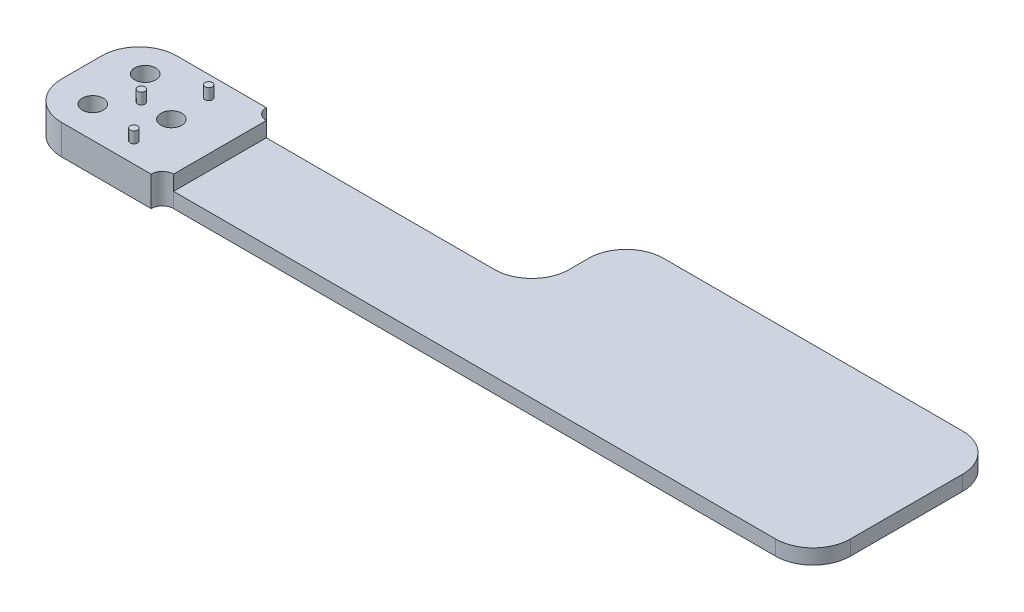
ISO-10303-21;
HEADER;
FILE_DESCRIPTION(('STEP AP214'),'2;1');
FILE_NAME('part.step','',(''),(''),'','','');
FILE_SCHEMA(('AUTOMOTIVE_DESIGN { 1 0 10303 214 1 1 1 1 }'));
ENDSEC;
DATA;
#1=APPLICATION_CONTEXT('core data for automotive mechanical design processes');
#2=APPLICATION_PROTOCOL_DEFINITION('international standard','automotive_design',2000,#1);
#3=PRODUCT_CONTEXT('',#1,'mechanical');
#4=PRODUCT('Part','Part','',(#3));
#5=PRODUCT_RELATED_PRODUCT_CATEGORY('part','',(#4));
#6=PRODUCT_DEFINITION_FORMATION('','',#4);
#7=PRODUCT_DEFINITION_CONTEXT('part definition',#1,'design');
#8=PRODUCT_DEFINITION('design','',#6,#7);
#9=PRODUCT_DEFINITION_SHAPE('','',#8);
#10=(LENGTH_UNIT() NAMED_UNIT(*) SI_UNIT(.MILLI.,.METRE.));
#11=(NAMED_UNIT(*) PLANE_ANGLE_UNIT() SI_UNIT($,.RADIAN.));
#12=(NAMED_UNIT(*) SI_UNIT($,.STERADIAN.) SOLID_ANGLE_UNIT());
#13=UNCERTAINTY_MEASURE_WITH_UNIT(LENGTH_MEASURE(1.E-05),#10,'distance_accuracy_value','');
#14=(GEOMETRIC_REPRESENTATION_CONTEXT(3) GLOBAL_UNCERTAINTY_ASSIGNED_CONTEXT((#13)) GLOBAL_UNIT_ASSIGNED_CONTEXT((#10,
#11,#12)) REPRESENTATION_CONTEXT('',''));
#15=CARTESIAN_POINT('',(0.,0.,0.));
#16=DIRECTION('',(0.,0.,1.));
#17=DIRECTION('',(1.,0.,0.));
#18=AXIS2_PLACEMENT_3D('',#15,#16,#17);
#19=CARTESIAN_POINT('',(54.,2.,0.));
#20=DIRECTION('',(0.,-1.,0.));
#21=DIRECTION('',(0.,0.,-1.));
#22=AXIS2_PLACEMENT_3D('',#19,#20,#21);
#23=PLANE('',#22);
#24=DIRECTION('',(0.,0.,-1.));
#25=VECTOR('',#24,1.);
#26=CARTESIAN_POINT('',(18.5,2.,0.));
#27=LINE('',#26,#25);
#28=CARTESIAN_POINT('',(18.5,2.,0.));
#29=VERTEX_POINT('',#28);
#30=CARTESIAN_POINT('',(18.5,2.,-12.4));
#31=VERTEX_POINT('',#30);
#32=EDGE_CURVE('E178',#29,#31,#27,.T.);
#33=ORIENTED_EDGE('',*,*,#32,.F.);
#34=DIRECTION('',(-1.,0.,0.));
#35=VECTOR('',#34,1.);
#36=CARTESIAN_POINT('',(54.,2.,0.));
#37=LINE('',#36,#35);
#38=CARTESIAN_POINT('',(99.,2.,0.));
#39=VERTEX_POINT('',#38);
#40=EDGE_CURVE('E169',#39,#29,#37,.T.);
#41=ORIENTED_EDGE('',*,*,#40,.F.);
#42=CARTESIAN_POINT('',(99.,2.,-5.));
#43=DIRECTION('',(0.,-1.,0.));
#44=DIRECTION('',(0.,0.,-1.));
#45=AXIS2_PLACEMENT_3D('',#42,#43,#44);
#46=CIRCLE('',#45,5.);
#47=CARTESIAN_POINT('',(104.,2.,-5.));
#48=VERTEX_POINT('',#47);
#49=EDGE_CURVE('E326',#39,#48,#46,.F.);
#50=ORIENTED_EDGE('',*,*,#49,.T.);
#51=DIRECTION('',(0.,0.,-1.));
#52=VECTOR('',#51,1.);
#53=CARTESIAN_POINT('',(104.,2.,0.));
#54=LINE('',#53,#52);
#55=CARTESIAN_POINT('',(104.,2.,-20.));
#56=VERTEX_POINT('',#55);
#57=EDGE_CURVE('E194',#48,#56,#54,.T.);
#58=ORIENTED_EDGE('',*,*,#57,.T.);
#59=CARTESIAN_POINT('',(99.,2.,-20.));
#60=DIRECTION('',(0.,-1.,0.));
#61=DIRECTION('',(0.,0.,-1.));
#62=AXIS2_PLACEMENT_3D('',#59,#60,#61);
#63=CIRCLE('',#62,5.);
#64=CARTESIAN_POINT('',(99.,2.,-25.));
#65=VERTEX_POINT('',#64);
#66=EDGE_CURVE('E45',#56,#65,#63,.F.);
#67=ORIENTED_EDGE('',*,*,#66,.T.);
#68=DIRECTION('',(-1.,0.,0.));
#69=VECTOR('',#68,1.);
#70=CARTESIAN_POINT('',(54.,2.,-25.));
#71=LINE('',#70,#69);
#72=CARTESIAN_POINT('',(59.,2.,-25.));
#73=VERTEX_POINT('',#72);
#74=EDGE_CURVE('E200',#65,#73,#71,.T.);
#75=ORIENTED_EDGE('',*,*,#74,.T.);
#76=CARTESIAN_POINT('',(59.,2.,-20.));
#77=DIRECTION('',(0.,-1.,0.));
#78=DIRECTION('',(0.,0.,-1.));
#79=AXIS2_PLACEMENT_3D('',#76,#77,#78);
#80=CIRCLE('',#79,5.);
#81=CARTESIAN_POINT('',(54.,2.,-20.));
#82=VERTEX_POINT('',#81);
#83=EDGE_CURVE('E307',#73,#82,#80,.F.);
#84=ORIENTED_EDGE('',*,*,#83,.T.);
#85=DIRECTION('',(0.,0.,1.));
#86=VECTOR('',#85,1.);
#87=CARTESIAN_POINT('',(54.,2.,0.));
#88=LINE('',#87,#86);
#89=CARTESIAN_POINT('',(54.,2.,-17.4));
#90=VERTEX_POINT('',#89);
#91=EDGE_CURVE('E196',#82,#90,#88,.T.);
#92=ORIENTED_EDGE('',*,*,#91,.T.);
#93=CARTESIAN_POINT('',(49.,2.,-17.4));
#94=DIRECTION('',(0.,-1.,0.));
#95=DIRECTION('',(0.,0.,-1.));
#96=AXIS2_PLACEMENT_3D('',#93,#94,#95);
#97=CIRCLE('',#96,5.);
#98=CARTESIAN_POINT('',(49.,2.,-12.4));
#99=VERTEX_POINT('',#98);
#100=EDGE_CURVE('E311',#90,#99,#97,.T.);
#101=ORIENTED_EDGE('',*,*,#100,.T.);
#102=DIRECTION('',(-1.,0.,0.));
#103=VECTOR('',#102,1.);
#104=CARTESIAN_POINT('',(54.,2.,-12.4));
#105=LINE('',#104,#103);
#106=EDGE_CURVE('E174',#99,#31,#105,.T.);
#107=ORIENTED_EDGE('',*,*,#106,.T.);
#108=EDGE_LOOP('',(#33,#41,#50,#58,#67,#75,#84,#92,#101,#107));
#109=FACE_BOUND('',#108,.T.);
#110=ADVANCED_FACE('F37',(#109),#23,.F.);
#111=CARTESIAN_POINT('',(0.,4.,-12.4));
#112=DIRECTION('',(0.,0.,1.));
#113=DIRECTION('',(1.,0.,0.));
#114=AXIS2_PLACEMENT_3D('',#111,#112,#113);
#115=PLANE('',#114);
#116=ORIENTED_EDGE('',*,*,#106,.F.);
#117=DIRECTION('',(0.,1.,0.));
#118=VECTOR('',#117,1.);
#119=CARTESIAN_POINT('',(49.,4.,-12.4));
#120=LINE('',#119,#118);
#121=CARTESIAN_POINT('',(49.,0.,-12.4));
#122=VERTEX_POINT('',#121);
#123=EDGE_CURVE('E309',#99,#122,#120,.F.);
#124=ORIENTED_EDGE('',*,*,#123,.T.);
#125=DIRECTION('',(-1.,0.,0.));
#126=VECTOR('',#125,1.);
#127=CARTESIAN_POINT('',(0.,0.,-12.4));
#128=LINE('',#127,#126);
#129=CARTESIAN_POINT('',(18.5,0.,-12.4));
#130=VERTEX_POINT('',#129);
#131=EDGE_CURVE('E264',#122,#130,#128,.T.);
#132=ORIENTED_EDGE('',*,*,#131,.T.);
#133=DIRECTION('',(0.,1.,0.));
#134=VECTOR('',#133,1.);
#135=CARTESIAN_POINT('',(18.5,-2.12132034355964,-12.4));
#136=LINE('',#135,#134);
#137=EDGE_CURVE('E167',#130,#31,#136,.T.);
#138=ORIENTED_EDGE('',*,*,#137,.T.);
#139=EDGE_LOOP('',(#116,#124,#132,#138));
#140=FACE_BOUND('',#139,.T.);
#141=ADVANCED_FACE('F394',(#140),#115,.F.);
#142=CARTESIAN_POINT('',(0.,4.,0.));
#143=DIRECTION('',(0.,0.,-1.));
#144=DIRECTION('',(-1.,0.,0.));
#145=AXIS2_PLACEMENT_3D('',#142,#143,#144);
#146=PLANE('',#145);
#147=DIRECTION('',(1.,0.,0.));
#148=VECTOR('',#147,1.);
#149=CARTESIAN_POINT('',(0.,0.,0.));
#150=LINE('',#149,#148);
#151=CARTESIAN_POINT('',(18.5,0.,0.));
#152=VERTEX_POINT('',#151);
#153=CARTESIAN_POINT('',(99.,0.,0.));
#154=VERTEX_POINT('',#153);
#155=EDGE_CURVE('E267',#152,#154,#150,.T.);
#156=ORIENTED_EDGE('',*,*,#155,.T.);
#157=DIRECTION('',(0.,-1.,0.));
#158=VECTOR('',#157,1.);
#159=CARTESIAN_POINT('',(99.,2.,0.));
#160=LINE('',#159,#158);
#161=EDGE_CURVE('E11',#154,#39,#160,.F.);
#162=ORIENTED_EDGE('',*,*,#161,.T.);
#163=ORIENTED_EDGE('',*,*,#40,.T.);
#164=DIRECTION('',(0.,1.,0.));
#165=VECTOR('',#164,1.);
#166=CARTESIAN_POINT('',(18.5,-2.12132034355964,0.));
#167=LINE('',#166,#165);
#168=EDGE_CURVE('E158',#152,#29,#167,.T.);
#169=ORIENTED_EDGE('',*,*,#168,.F.);
#170=EDGE_LOOP('',(#156,#162,#163,#169));
#171=FACE_BOUND('',#170,.T.);
#172=ADVANCED_FACE('F171',(#171),#146,.F.);
#173=CARTESIAN_POINT('',(0.,4.,0.));
#174=DIRECTION('',(1.,0.,0.));
#175=DIRECTION('',(0.,0.,-1.));
#176=AXIS2_PLACEMENT_3D('',#173,#174,#175);
#177=PLANE('',#176);
#178=DIRECTION('',(0.,0.,1.));
#179=VECTOR('',#178,1.);
#180=CARTESIAN_POINT('',(0.,4.,0.));
#181=LINE('',#180,#179);
#182=CARTESIAN_POINT('',(0.,4.,-8.89999999999999));
#183=VERTEX_POINT('',#182);
#184=CARTESIAN_POINT('',(0.,4.,-3.5));
#185=VERTEX_POINT('',#184);
#186=EDGE_CURVE('E260',#183,#185,#181,.T.);
#187=ORIENTED_EDGE('',*,*,#186,.F.);
#188=DIRECTION('',(0.,1.,0.));
#189=VECTOR('',#188,1.);
#190=CARTESIAN_POINT('',(0.,0.,-8.9));
#191=LINE('',#190,#189);
#192=CARTESIAN_POINT('',(0.,0.,-8.89999999999999));
#193=VERTEX_POINT('',#192);
#194=EDGE_CURVE('E279',#183,#193,#191,.F.);
#195=ORIENTED_EDGE('',*,*,#194,.T.);
#196=DIRECTION('',(0.,0.,1.));
#197=VECTOR('',#196,1.);
#198=CARTESIAN_POINT('',(0.,0.,0.));
#199=LINE('',#198,#197);
#200=CARTESIAN_POINT('',(0.,0.,-3.5));
#201=VERTEX_POINT('',#200);
#202=EDGE_CURVE('E245',#193,#201,#199,.T.);
#203=ORIENTED_EDGE('',*,*,#202,.T.);
#204=DIRECTION('',(0.,1.,0.));
#205=VECTOR('',#204,1.);
#206=CARTESIAN_POINT('',(0.,4.,-3.5));
#207=LINE('',#206,#205);
#208=EDGE_CURVE('E276',#201,#185,#207,.T.);
#209=ORIENTED_EDGE('',*,*,#208,.T.);
#210=EDGE_LOOP('',(#187,#195,#203,#209));
#211=FACE_BOUND('',#210,.T.);
#212=ADVANCED_FACE('F355',(#211),#177,.F.);
#213=CARTESIAN_POINT('',(0.,4.,0.));
#214=DIRECTION('',(0.,-1.,0.));
#215=DIRECTION('',(0.,0.,-1.));
#216=AXIS2_PLACEMENT_3D('',#213,#214,#215);
#217=PLANE('',#216);
#218=CARTESIAN_POINT('',(12.,4.,-1.2));
#219=DIRECTION('',(0.,-1.,0.));
#220=DIRECTION('',(0.,0.,-1.));
#221=AXIS2_PLACEMENT_3D('',#218,#219,#220);
#222=CIRCLE('',#221,0.500000000000001);
#223=CARTESIAN_POINT('',(12.,4.,-1.7));
#224=VERTEX_POINT('',#223);
#225=EDGE_CURVE('E293',#224,#224,#222,.F.);
#226=ORIENTED_EDGE('',*,*,#225,.F.);
#227=EDGE_LOOP('',(#226));
#228=FACE_BOUND('',#227,.T.);
#229=CARTESIAN_POINT('',(12.,4.,-11.2));
#230=DIRECTION('',(0.,-1.,0.));
#231=DIRECTION('',(0.,0.,-1.));
#232=AXIS2_PLACEMENT_3D('',#229,#230,#231);
#233=CIRCLE('',#232,0.500000000000001);
#234=CARTESIAN_POINT('',(12.,4.,-11.7));
#235=VERTEX_POINT('',#234);
#236=EDGE_CURVE('E290',#235,#235,#233,.F.);
#237=ORIENTED_EDGE('',*,*,#236,.F.);
#238=EDGE_LOOP('',(#237));
#239=FACE_BOUND('',#238,.T.);
#240=CARTESIAN_POINT('',(8.,4.,-6.2));
#241=DIRECTION('',(0.,-1.,0.));
#242=DIRECTION('',(0.,0.,-1.));
#243=AXIS2_PLACEMENT_3D('',#240,#241,#242);
#244=CIRCLE('',#243,0.500000000000001);
#245=CARTESIAN_POINT('',(8.,4.,-6.7));
#246=VERTEX_POINT('',#245);
#247=EDGE_CURVE('E287',#246,#246,#244,.F.);
#248=ORIENTED_EDGE('',*,*,#247,.F.);
#249=EDGE_LOOP('',(#248));
#250=FACE_BOUND('',#249,.T.);
#251=CARTESIAN_POINT('',(12.,4.,-6.2));
#252=DIRECTION('',(0.,1.,0.));
#253=DIRECTION('',(0.,0.,1.));
#254=AXIS2_PLACEMENT_3D('',#251,#252,#253);
#255=CIRCLE('',#254,1.4);
#256=CARTESIAN_POINT('',(12.,4.,-4.8));
#257=VERTEX_POINT('',#256);
#258=EDGE_CURVE('E246',#257,#257,#255,.T.);
#259=ORIENTED_EDGE('',*,*,#258,.F.);
#260=EDGE_LOOP('',(#259));
#261=FACE_BOUND('',#260,.T.);
#262=CARTESIAN_POINT('',(5.,4.,-9.7));
#263=DIRECTION('',(0.,1.,0.));
#264=DIRECTION('',(0.,0.,1.));
#265=AXIS2_PLACEMENT_3D('',#262,#263,#264);
#266=CIRCLE('',#265,1.4);
#267=CARTESIAN_POINT('',(5.,4.,-8.3));
#268=VERTEX_POINT('',#267);
#269=EDGE_CURVE('E252',#268,#268,#266,.T.);
#270=ORIENTED_EDGE('',*,*,#269,.F.);
#271=EDGE_LOOP('',(#270));
#272=FACE_BOUND('',#271,.T.);
#273=CARTESIAN_POINT('',(5.,4.,-2.7));
#274=DIRECTION('',(0.,1.,0.));
#275=DIRECTION('',(0.,0.,1.));
#276=AXIS2_PLACEMENT_3D('',#273,#274,#275);
#277=CIRCLE('',#276,1.4);
#278=CARTESIAN_POINT('',(5.,4.,-1.3));
#279=VERTEX_POINT('',#278);
#280=EDGE_CURVE('E241',#279,#279,#277,.T.);
#281=ORIENTED_EDGE('',*,*,#280,.F.);
#282=EDGE_LOOP('',(#281));
#283=FACE_BOUND('',#282,.T.);
#284=DIRECTION('',(-1.,0.,0.));
#285=VECTOR('',#284,1.);
#286=CARTESIAN_POINT('',(17.,4.,-13.9));
#287=LINE('',#286,#285);
#288=CARTESIAN_POINT('',(17.,4.,-13.9));
#289=VERTEX_POINT('',#288);
#290=CARTESIAN_POINT('',(5.,4.,-13.9));
#291=VERTEX_POINT('',#290);
#292=EDGE_CURVE('E233',#289,#291,#287,.T.);
#293=ORIENTED_EDGE('',*,*,#292,.T.);
#294=CARTESIAN_POINT('',(5.,4.,-8.9));
#295=DIRECTION('',(0.,-1.,0.));
#296=DIRECTION('',(0.,0.,-1.));
#297=AXIS2_PLACEMENT_3D('',#294,#295,#296);
#298=CIRCLE('',#297,5.);
#299=EDGE_CURVE('E274',#291,#183,#298,.F.);
#300=ORIENTED_EDGE('',*,*,#299,.T.);
#301=ORIENTED_EDGE('',*,*,#186,.T.);
#302=CARTESIAN_POINT('',(5.,4.,-3.5));
#303=DIRECTION('',(0.,-1.,0.));
#304=DIRECTION('',(0.,0.,-1.));
#305=AXIS2_PLACEMENT_3D('',#302,#303,#304);
#306=CIRCLE('',#305,5.);
#307=CARTESIAN_POINT('',(5.,4.,1.5));
#308=VERTEX_POINT('',#307);
#309=EDGE_CURVE('E272',#185,#308,#306,.F.);
#310=ORIENTED_EDGE('',*,*,#309,.T.);
#311=DIRECTION('',(1.,0.,0.));
#312=VECTOR('',#311,1.);
#313=CARTESIAN_POINT('',(17.,4.,1.5));
#314=LINE('',#313,#312);
#315=CARTESIAN_POINT('',(17.,4.,1.5));
#316=VERTEX_POINT('',#315);
#317=EDGE_CURVE('E225',#308,#316,#314,.T.);
#318=ORIENTED_EDGE('',*,*,#317,.T.);
#319=CARTESIAN_POINT('',(18.5,4.,1.5));
#320=DIRECTION('',(0.,-1.,0.));
#321=DIRECTION('',(0.,0.,-1.));
#322=AXIS2_PLACEMENT_3D('',#319,#320,#321);
#323=CIRCLE('',#322,1.5);
#324=CARTESIAN_POINT('',(18.5,4.,0.));
#325=VERTEX_POINT('',#324);
#326=EDGE_CURVE('E205',#325,#316,#323,.F.);
#327=ORIENTED_EDGE('',*,*,#326,.F.);
#328=DIRECTION('',(0.,0.,1.));
#329=VECTOR('',#328,1.);
#330=CARTESIAN_POINT('',(18.5,4.,0.));
#331=LINE('',#330,#329);
#332=CARTESIAN_POINT('',(18.5,4.,-12.4));
#333=VERTEX_POINT('',#332);
#334=EDGE_CURVE('E186',#333,#325,#331,.T.);
#335=ORIENTED_EDGE('',*,*,#334,.F.);
#336=CARTESIAN_POINT('',(18.5,4.,-13.9));
#337=DIRECTION('',(0.,-1.,0.));
#338=DIRECTION('',(0.,0.,-1.));
#339=AXIS2_PLACEMENT_3D('',#336,#337,#338);
#340=CIRCLE('',#339,1.5);
#341=EDGE_CURVE('E187',#289,#333,#340,.F.);
#342=ORIENTED_EDGE('',*,*,#341,.F.);
#343=EDGE_LOOP('',(#293,#300,#301,#310,#318,#327,#335,#342));
#344=FACE_BOUND('',#343,.T.);
#345=ADVANCED_FACE('F428',(#228,#239,#250,#261,#272,#283,#344),#217,.F.);
#346=CARTESIAN_POINT('',(0.,0.,0.));
#347=DIRECTION('',(0.,-1.,0.));
#348=DIRECTION('',(0.,0.,-1.));
#349=AXIS2_PLACEMENT_3D('',#346,#347,#348);
#350=PLANE('',#349);
#351=DIRECTION('',(1.,0.,0.));
#352=VECTOR('',#351,1.);
#353=CARTESIAN_POINT('',(54.,0.,-25.));
#354=LINE('',#353,#352);
#355=CARTESIAN_POINT('',(59.,0.,-25.));
#356=VERTEX_POINT('',#355);
#357=CARTESIAN_POINT('',(99.,0.,-25.));
#358=VERTEX_POINT('',#357);
#359=EDGE_CURVE('E204',#356,#358,#354,.T.);
#360=ORIENTED_EDGE('',*,*,#359,.T.);
#361=CARTESIAN_POINT('',(99.,0.,-20.));
#362=DIRECTION('',(0.,-1.,0.));
#363=DIRECTION('',(0.,0.,-1.));
#364=AXIS2_PLACEMENT_3D('',#361,#362,#363);
#365=CIRCLE('',#364,5.);
#366=CARTESIAN_POINT('',(104.,0.,-20.));
#367=VERTEX_POINT('',#366);
#368=EDGE_CURVE('E320',#358,#367,#365,.T.);
#369=ORIENTED_EDGE('',*,*,#368,.T.);
#370=DIRECTION('',(0.,0.,1.));
#371=VECTOR('',#370,1.);
#372=CARTESIAN_POINT('',(104.,0.,0.));
#373=LINE('',#372,#371);
#374=CARTESIAN_POINT('',(104.,0.,-5.));
#375=VERTEX_POINT('',#374);
#376=EDGE_CURVE('E197',#367,#375,#373,.T.);
#377=ORIENTED_EDGE('',*,*,#376,.T.);
#378=CARTESIAN_POINT('',(99.,0.,-5.));
#379=DIRECTION('',(0.,-1.,0.));
#380=DIRECTION('',(0.,0.,-1.));
#381=AXIS2_PLACEMENT_3D('',#378,#379,#380);
#382=CIRCLE('',#381,5.);
#383=EDGE_CURVE('E318',#375,#154,#382,.T.);
#384=ORIENTED_EDGE('',*,*,#383,.T.);
#385=ORIENTED_EDGE('',*,*,#155,.F.);
#386=CARTESIAN_POINT('',(18.5,0.,1.5));
#387=DIRECTION('',(0.,-1.,0.));
#388=DIRECTION('',(0.,0.,-1.));
#389=AXIS2_PLACEMENT_3D('',#386,#387,#388);
#390=CIRCLE('',#389,1.5);
#391=CARTESIAN_POINT('',(17.,0.,1.5));
#392=VERTEX_POINT('',#391);
#393=EDGE_CURVE('E165',#392,#152,#390,.T.);
#394=ORIENTED_EDGE('',*,*,#393,.F.);
#395=DIRECTION('',(1.,0.,0.));
#396=VECTOR('',#395,1.);
#397=CARTESIAN_POINT('',(17.,0.,1.5));
#398=LINE('',#397,#396);
#399=CARTESIAN_POINT('',(5.,0.,1.5));
#400=VERTEX_POINT('',#399);
#401=EDGE_CURVE('E228',#400,#392,#398,.T.);
#402=ORIENTED_EDGE('',*,*,#401,.F.);
#403=CARTESIAN_POINT('',(5.,0.,-3.5));
#404=DIRECTION('',(0.,-1.,0.));
#405=DIRECTION('',(0.,0.,-1.));
#406=AXIS2_PLACEMENT_3D('',#403,#404,#405);
#407=CIRCLE('',#406,5.);
#408=EDGE_CURVE('E281',#400,#201,#407,.T.);
#409=ORIENTED_EDGE('',*,*,#408,.T.);
#410=ORIENTED_EDGE('',*,*,#202,.F.);
#411=CARTESIAN_POINT('',(5.,0.,-8.9));
#412=DIRECTION('',(0.,-1.,0.));
#413=DIRECTION('',(0.,0.,-1.));
#414=AXIS2_PLACEMENT_3D('',#411,#412,#413);
#415=CIRCLE('',#414,5.);
#416=CARTESIAN_POINT('',(5.,0.,-13.9));
#417=VERTEX_POINT('',#416);
#418=EDGE_CURVE('E283',#193,#417,#415,.T.);
#419=ORIENTED_EDGE('',*,*,#418,.T.);
#420=DIRECTION('',(-1.,0.,0.));
#421=VECTOR('',#420,1.);
#422=CARTESIAN_POINT('',(17.,0.,-13.9));
#423=LINE('',#422,#421);
#424=CARTESIAN_POINT('',(17.,0.,-13.9));
#425=VERTEX_POINT('',#424);
#426=EDGE_CURVE('E236',#425,#417,#423,.T.);
#427=ORIENTED_EDGE('',*,*,#426,.F.);
#428=CARTESIAN_POINT('',(18.5,0.,-13.9));
#429=DIRECTION('',(0.,-1.,0.));
#430=DIRECTION('',(0.,0.,-1.));
#431=AXIS2_PLACEMENT_3D('',#428,#429,#430);
#432=CIRCLE('',#431,1.5);
#433=EDGE_CURVE('E212',#130,#425,#432,.T.);
#434=ORIENTED_EDGE('',*,*,#433,.F.);
#435=ORIENTED_EDGE('',*,*,#131,.F.);
#436=CARTESIAN_POINT('',(49.,0.,-17.4));
#437=DIRECTION('',(0.,-1.,0.));
#438=DIRECTION('',(0.,0.,-1.));
#439=AXIS2_PLACEMENT_3D('',#436,#437,#438);
#440=CIRCLE('',#439,5.);
#441=CARTESIAN_POINT('',(54.,0.,-17.4));
#442=VERTEX_POINT('',#441);
#443=EDGE_CURVE('E313',#122,#442,#440,.F.);
#444=ORIENTED_EDGE('',*,*,#443,.T.);
#445=DIRECTION('',(0.,0.,-1.));
#446=VECTOR('',#445,1.);
#447=CARTESIAN_POINT('',(54.,0.,0.));
#448=LINE('',#447,#446);
#449=CARTESIAN_POINT('',(54.,0.,-20.));
#450=VERTEX_POINT('',#449);
#451=EDGE_CURVE('E201',#442,#450,#448,.T.);
#452=ORIENTED_EDGE('',*,*,#451,.T.);
#453=CARTESIAN_POINT('',(59.,0.,-20.));
#454=DIRECTION('',(0.,-1.,0.));
#455=DIRECTION('',(0.,0.,-1.));
#456=AXIS2_PLACEMENT_3D('',#453,#454,#455);
#457=CIRCLE('',#456,5.);
#458=EDGE_CURVE('E302',#450,#356,#457,.T.);
#459=ORIENTED_EDGE('',*,*,#458,.T.);
#460=EDGE_LOOP('',(#360,#369,#377,#384,#385,#394,#402,#409,#410,#419,#427,#434,#435,#444,#452,#459));
#461=FACE_BOUND('',#460,.T.);
#462=ADVANCED_FACE('F338',(#461),#350,.T.);
#463=CARTESIAN_POINT('',(5.,1.,-2.7));
#464=DIRECTION('',(0.,1.,0.));
#465=DIRECTION('',(0.,0.,1.));
#466=AXIS2_PLACEMENT_3D('',#463,#464,#465);
#467=CYLINDRICAL_SURFACE('',#466,1.4);
#468=CARTESIAN_POINT('',(5.,1.,-2.7));
#469=DIRECTION('',(0.,1.,0.));
#470=DIRECTION('',(0.,0.,1.));
#471=AXIS2_PLACEMENT_3D('',#468,#469,#470);
#472=CIRCLE('',#471,1.4);
#473=CARTESIAN_POINT('',(5.,1.,-1.3));
#474=VERTEX_POINT('',#473);
#475=EDGE_CURVE('E255',#474,#474,#472,.T.);
#476=ORIENTED_EDGE('',*,*,#475,.F.);
#477=EDGE_LOOP('',(#476));
#478=FACE_BOUND('',#477,.T.);
#479=ORIENTED_EDGE('',*,*,#280,.T.);
#480=EDGE_LOOP('',(#479));
#481=FACE_BOUND('',#480,.T.);
#482=ADVANCED_FACE('F423',(#478,#481),#467,.F.);
#483=CARTESIAN_POINT('',(5.,1.,-2.7));
#484=DIRECTION('',(0.,1.,0.));
#485=DIRECTION('',(0.,0.,1.));
#486=AXIS2_PLACEMENT_3D('',#483,#484,#485);
#487=PLANE('',#486);
#488=ORIENTED_EDGE('',*,*,#475,.T.);
#489=EDGE_LOOP('',(#488));
#490=FACE_BOUND('',#489,.T.);
#491=ADVANCED_FACE('F419',(#490),#487,.T.);
#492=CARTESIAN_POINT('',(5.,1.,-9.7));
#493=DIRECTION('',(0.,1.,0.));
#494=DIRECTION('',(0.,0.,1.));
#495=AXIS2_PLACEMENT_3D('',#492,#493,#494);
#496=CYLINDRICAL_SURFACE('',#495,1.4);
#497=CARTESIAN_POINT('',(5.,1.,-9.7));
#498=DIRECTION('',(0.,1.,0.));
#499=DIRECTION('',(0.,0.,1.));
#500=AXIS2_PLACEMENT_3D('',#497,#498,#499);
#501=CIRCLE('',#500,1.4);
#502=CARTESIAN_POINT('',(5.,1.,-8.3));
#503=VERTEX_POINT('',#502);
#504=EDGE_CURVE('E249',#503,#503,#501,.T.);
#505=ORIENTED_EDGE('',*,*,#504,.F.);
#506=EDGE_LOOP('',(#505));
#507=FACE_BOUND('',#506,.T.);
#508=ORIENTED_EDGE('',*,*,#269,.T.);
#509=EDGE_LOOP('',(#508));
#510=FACE_BOUND('',#509,.T.);
#511=ADVANCED_FACE('F415',(#507,#510),#496,.F.);
#512=CARTESIAN_POINT('',(5.,1.,-9.7));
#513=DIRECTION('',(0.,1.,0.));
#514=DIRECTION('',(0.,0.,1.));
#515=AXIS2_PLACEMENT_3D('',#512,#513,#514);
#516=PLANE('',#515);
#517=ORIENTED_EDGE('',*,*,#504,.T.);
#518=EDGE_LOOP('',(#517));
#519=FACE_BOUND('',#518,.T.);
#520=ADVANCED_FACE('F411',(#519),#516,.T.);
#521=CARTESIAN_POINT('',(12.,1.,-6.2));
#522=DIRECTION('',(0.,1.,0.));
#523=DIRECTION('',(0.,0.,1.));
#524=AXIS2_PLACEMENT_3D('',#521,#522,#523);
#525=CYLINDRICAL_SURFACE('',#524,1.4);
#526=CARTESIAN_POINT('',(12.,1.,-6.2));
#527=DIRECTION('',(0.,1.,0.));
#528=DIRECTION('',(0.,0.,1.));
#529=AXIS2_PLACEMENT_3D('',#526,#527,#528);
#530=CIRCLE('',#529,1.4);
#531=CARTESIAN_POINT('',(12.,1.,-4.8));
#532=VERTEX_POINT('',#531);
#533=EDGE_CURVE('E242',#532,#532,#530,.T.);
#534=ORIENTED_EDGE('',*,*,#533,.F.);
#535=EDGE_LOOP('',(#534));
#536=FACE_BOUND('',#535,.T.);
#537=ORIENTED_EDGE('',*,*,#258,.T.);
#538=EDGE_LOOP('',(#537));
#539=FACE_BOUND('',#538,.T.);
#540=ADVANCED_FACE('F407',(#536,#539),#525,.F.);
#541=CARTESIAN_POINT('',(12.,1.,-6.2));
#542=DIRECTION('',(0.,1.,0.));
#543=DIRECTION('',(0.,0.,1.));
#544=AXIS2_PLACEMENT_3D('',#541,#542,#543);
#545=PLANE('',#544);
#546=ORIENTED_EDGE('',*,*,#533,.T.);
#547=EDGE_LOOP('',(#546));
#548=FACE_BOUND('',#547,.T.);
#549=ADVANCED_FACE('F404',(#548),#545,.T.);
#550=CARTESIAN_POINT('',(17.,-17.066048165876,-13.9));
#551=DIRECTION('',(0.,0.,-1.));
#552=DIRECTION('',(-1.,0.,0.));
#553=AXIS2_PLACEMENT_3D('',#550,#551,#552);
#554=PLANE('',#553);
#555=ORIENTED_EDGE('',*,*,#426,.T.);
#556=DIRECTION('',(0.,1.,0.));
#557=VECTOR('',#556,1.);
#558=CARTESIAN_POINT('',(5.,4.,-13.9));
#559=LINE('',#558,#557);
#560=EDGE_CURVE('E263',#417,#291,#559,.T.);
#561=ORIENTED_EDGE('',*,*,#560,.T.);
#562=ORIENTED_EDGE('',*,*,#292,.F.);
#563=DIRECTION('',(0.,1.,0.));
#564=VECTOR('',#563,1.);
#565=CARTESIAN_POINT('',(17.,-17.066048165876,-13.9));
#566=LINE('',#565,#564);
#567=EDGE_CURVE('E175',#425,#289,#566,.T.);
#568=ORIENTED_EDGE('',*,*,#567,.F.);
#569=EDGE_LOOP('',(#555,#561,#562,#568));
#570=FACE_BOUND('',#569,.T.);
#571=ADVANCED_FACE('F363',(#570),#554,.T.);
#572=CARTESIAN_POINT('',(17.,-17.066048165876,1.5));
#573=DIRECTION('',(0.,0.,1.));
#574=DIRECTION('',(1.,0.,0.));
#575=AXIS2_PLACEMENT_3D('',#572,#573,#574);
#576=PLANE('',#575);
#577=ORIENTED_EDGE('',*,*,#317,.F.);
#578=DIRECTION('',(0.,1.,0.));
#579=VECTOR('',#578,1.);
#580=CARTESIAN_POINT('',(5.,0.,1.5));
#581=LINE('',#580,#579);
#582=EDGE_CURVE('E285',#308,#400,#581,.F.);
#583=ORIENTED_EDGE('',*,*,#582,.T.);
#584=ORIENTED_EDGE('',*,*,#401,.T.);
#585=DIRECTION('',(0.,1.,0.));
#586=VECTOR('',#585,1.);
#587=CARTESIAN_POINT('',(17.,-17.066048165876,1.5));
#588=LINE('',#587,#586);
#589=EDGE_CURVE('E231',#392,#316,#588,.T.);
#590=ORIENTED_EDGE('',*,*,#589,.T.);
#591=EDGE_LOOP('',(#577,#583,#584,#590));
#592=FACE_BOUND('',#591,.T.);
#593=ADVANCED_FACE('F346',(#592),#576,.T.);
#594=CARTESIAN_POINT('',(5.,-17.066048165876,-8.9));
#595=DIRECTION('',(0.,-1.,0.));
#596=DIRECTION('',(0.,0.,-1.));
#597=AXIS2_PLACEMENT_3D('',#594,#595,#596);
#598=CYLINDRICAL_SURFACE('',#597,5.);
#599=ORIENTED_EDGE('',*,*,#418,.F.);
#600=ORIENTED_EDGE('',*,*,#194,.F.);
#601=ORIENTED_EDGE('',*,*,#299,.F.);
#602=ORIENTED_EDGE('',*,*,#560,.F.);
#603=EDGE_LOOP('',(#599,#600,#601,#602));
#604=FACE_BOUND('',#603,.T.);
#605=ADVANCED_FACE('F358',(#604),#598,.T.);
#606=CARTESIAN_POINT('',(5.,4.,-3.5));
#607=DIRECTION('',(0.,-1.,0.));
#608=DIRECTION('',(0.,0.,-1.));
#609=AXIS2_PLACEMENT_3D('',#606,#607,#608);
#610=CYLINDRICAL_SURFACE('',#609,5.);
#611=ORIENTED_EDGE('',*,*,#408,.F.);
#612=ORIENTED_EDGE('',*,*,#582,.F.);
#613=ORIENTED_EDGE('',*,*,#309,.F.);
#614=ORIENTED_EDGE('',*,*,#208,.F.);
#615=EDGE_LOOP('',(#611,#612,#613,#614));
#616=FACE_BOUND('',#615,.T.);
#617=ADVANCED_FACE('F349',(#616),#610,.T.);
#618=CARTESIAN_POINT('',(8.,5.5,-6.2));
#619=DIRECTION('',(0.,-1.,0.));
#620=DIRECTION('',(0.,0.,-1.));
#621=AXIS2_PLACEMENT_3D('',#618,#619,#620);
#622=CYLINDRICAL_SURFACE('',#621,0.500000000000001);
#623=CARTESIAN_POINT('',(8.,5.5,-6.2));
#624=DIRECTION('',(0.,1.,0.));
#625=DIRECTION('',(0.,0.,1.));
#626=AXIS2_PLACEMENT_3D('',#623,#624,#625);
#627=CIRCLE('',#626,0.500000000000001);
#628=CARTESIAN_POINT('',(8.,5.5,-5.7));
#629=VERTEX_POINT('',#628);
#630=EDGE_CURVE('E222',#629,#629,#627,.T.);
#631=ORIENTED_EDGE('',*,*,#630,.F.);
#632=EDGE_LOOP('',(#631));
#633=FACE_BOUND('',#632,.T.);
#634=ORIENTED_EDGE('',*,*,#247,.T.);
#635=EDGE_LOOP('',(#634));
#636=FACE_BOUND('',#635,.T.);
#637=ADVANCED_FACE('F440',(#633,#636),#622,.T.);
#638=CARTESIAN_POINT('',(8.,5.5,-6.2));
#639=DIRECTION('',(0.,1.,0.));
#640=DIRECTION('',(0.,0.,1.));
#641=AXIS2_PLACEMENT_3D('',#638,#639,#640);
#642=PLANE('',#641);
#643=ORIENTED_EDGE('',*,*,#630,.T.);
#644=EDGE_LOOP('',(#643));
#645=FACE_BOUND('',#644,.T.);
#646=ADVANCED_FACE('F444',(#645),#642,.T.);
#647=CARTESIAN_POINT('',(12.,5.5,-11.2));
#648=DIRECTION('',(0.,-1.,0.));
#649=DIRECTION('',(0.,0.,-1.));
#650=AXIS2_PLACEMENT_3D('',#647,#648,#649);
#651=CYLINDRICAL_SURFACE('',#650,0.500000000000001);
#652=CARTESIAN_POINT('',(12.,5.5,-11.2));
#653=DIRECTION('',(0.,1.,0.));
#654=DIRECTION('',(0.,0.,1.));
#655=AXIS2_PLACEMENT_3D('',#652,#653,#654);
#656=CIRCLE('',#655,0.500000000000001);
#657=CARTESIAN_POINT('',(12.,5.5,-10.7));
#658=VERTEX_POINT('',#657);
#659=EDGE_CURVE('E219',#658,#658,#656,.T.);
#660=ORIENTED_EDGE('',*,*,#659,.F.);
#661=EDGE_LOOP('',(#660));
#662=FACE_BOUND('',#661,.T.);
#663=ORIENTED_EDGE('',*,*,#236,.T.);
#664=EDGE_LOOP('',(#663));
#665=FACE_BOUND('',#664,.T.);
#666=ADVANCED_FACE('F450',(#662,#665),#651,.T.);
#667=CARTESIAN_POINT('',(12.,5.5,-11.2));
#668=DIRECTION('',(0.,1.,0.));
#669=DIRECTION('',(0.,0.,1.));
#670=AXIS2_PLACEMENT_3D('',#667,#668,#669);
#671=PLANE('',#670);
#672=ORIENTED_EDGE('',*,*,#659,.T.);
#673=EDGE_LOOP('',(#672));
#674=FACE_BOUND('',#673,.T.);
#675=ADVANCED_FACE('F588',(#674),#671,.T.);
#676=CARTESIAN_POINT('',(12.,5.5,-1.2));
#677=DIRECTION('',(0.,-1.,0.));
#678=DIRECTION('',(0.,0.,-1.));
#679=AXIS2_PLACEMENT_3D('',#676,#677,#678);
#680=CYLINDRICAL_SURFACE('',#679,0.500000000000001);
#681=CARTESIAN_POINT('',(12.,5.5,-1.2));
#682=DIRECTION('',(0.,1.,0.));
#683=DIRECTION('',(0.,0.,1.));
#684=AXIS2_PLACEMENT_3D('',#681,#682,#683);
#685=CIRCLE('',#684,0.500000000000001);
#686=CARTESIAN_POINT('',(12.,5.5,-0.699999999999999));
#687=VERTEX_POINT('',#686);
#688=EDGE_CURVE('E215',#687,#687,#685,.T.);
#689=ORIENTED_EDGE('',*,*,#688,.F.);
#690=EDGE_LOOP('',(#689));
#691=FACE_BOUND('',#690,.T.);
#692=ORIENTED_EDGE('',*,*,#225,.T.);
#693=EDGE_LOOP('',(#692));
#694=FACE_BOUND('',#693,.T.);
#695=ADVANCED_FACE('F585',(#691,#694),#680,.T.);
#696=CARTESIAN_POINT('',(12.,5.5,-1.2));
#697=DIRECTION('',(0.,1.,0.));
#698=DIRECTION('',(0.,0.,1.));
#699=AXIS2_PLACEMENT_3D('',#696,#697,#698);
#700=PLANE('',#699);
#701=ORIENTED_EDGE('',*,*,#688,.T.);
#702=EDGE_LOOP('',(#701));
#703=FACE_BOUND('',#702,.T.);
#704=ADVANCED_FACE('F504',(#703),#700,.T.);
#705=CARTESIAN_POINT('',(18.5,-2.12132034355964,-13.9));
#706=DIRECTION('',(0.,1.,0.));
#707=DIRECTION('',(0.,0.,1.));
#708=AXIS2_PLACEMENT_3D('',#705,#706,#707);
#709=CYLINDRICAL_SURFACE('',#708,1.5);
#710=ORIENTED_EDGE('',*,*,#137,.F.);
#711=ORIENTED_EDGE('',*,*,#433,.T.);
#712=ORIENTED_EDGE('',*,*,#567,.T.);
#713=ORIENTED_EDGE('',*,*,#341,.T.);
#714=DIRECTION('',(0.,-1.,0.));
#715=VECTOR('',#714,1.);
#716=CARTESIAN_POINT('',(18.5,19.4728794993046,-12.4));
#717=LINE('',#716,#715);
#718=EDGE_CURVE('E183',#333,#31,#717,.T.);
#719=ORIENTED_EDGE('',*,*,#718,.T.);
#720=EDGE_LOOP('',(#710,#711,#712,#713,#719));
#721=FACE_BOUND('',#720,.T.);
#722=ADVANCED_FACE('F368',(#721),#709,.F.);
#723=CARTESIAN_POINT('',(18.5,-2.12132034355964,1.5));
#724=DIRECTION('',(0.,1.,0.));
#725=DIRECTION('',(0.,0.,1.));
#726=AXIS2_PLACEMENT_3D('',#723,#724,#725);
#727=CYLINDRICAL_SURFACE('',#726,1.5);
#728=ORIENTED_EDGE('',*,*,#589,.F.);
#729=ORIENTED_EDGE('',*,*,#393,.T.);
#730=ORIENTED_EDGE('',*,*,#168,.T.);
#731=DIRECTION('',(0.,-1.,0.));
#732=VECTOR('',#731,1.);
#733=CARTESIAN_POINT('',(18.5,19.4728794993046,0.));
#734=LINE('',#733,#732);
#735=EDGE_CURVE('E163',#325,#29,#734,.T.);
#736=ORIENTED_EDGE('',*,*,#735,.F.);
#737=ORIENTED_EDGE('',*,*,#326,.T.);
#738=EDGE_LOOP('',(#728,#729,#730,#736,#737));
#739=FACE_BOUND('',#738,.T.);
#740=ADVANCED_FACE('F160',(#739),#727,.F.);
#741=CARTESIAN_POINT('',(54.,57.9016994374948,0.));
#742=DIRECTION('',(-1.,0.,0.));
#743=DIRECTION('',(0.,0.,1.));
#744=AXIS2_PLACEMENT_3D('',#741,#742,#743);
#745=PLANE('',#744);
#746=ORIENTED_EDGE('',*,*,#91,.F.);
#747=DIRECTION('',(0.,-1.,0.));
#748=VECTOR('',#747,1.);
#749=CARTESIAN_POINT('',(54.,57.9016994374948,-20.));
#750=LINE('',#749,#748);
#751=EDGE_CURVE('E299',#82,#450,#750,.T.);
#752=ORIENTED_EDGE('',*,*,#751,.T.);
#753=ORIENTED_EDGE('',*,*,#451,.F.);
#754=DIRECTION('',(0.,1.,0.));
#755=VECTOR('',#754,1.);
#756=CARTESIAN_POINT('',(54.,57.9016994374948,-17.4));
#757=LINE('',#756,#755);
#758=EDGE_CURVE('E296',#442,#90,#757,.T.);
#759=ORIENTED_EDGE('',*,*,#758,.T.);
#760=EDGE_LOOP('',(#746,#752,#753,#759));
#761=FACE_BOUND('',#760,.T.);
#762=ADVANCED_FACE('F379',(#761),#745,.T.);
#763=CARTESIAN_POINT('',(104.,57.9016994374948,0.));
#764=DIRECTION('',(1.,0.,0.));
#765=DIRECTION('',(0.,0.,-1.));
#766=AXIS2_PLACEMENT_3D('',#763,#764,#765);
#767=PLANE('',#766);
#768=ORIENTED_EDGE('',*,*,#376,.F.);
#769=DIRECTION('',(0.,-1.,0.));
#770=VECTOR('',#769,1.);
#771=CARTESIAN_POINT('',(104.,57.9016994374948,-20.));
#772=LINE('',#771,#770);
#773=EDGE_CURVE('E58',#367,#56,#772,.F.);
#774=ORIENTED_EDGE('',*,*,#773,.T.);
#775=ORIENTED_EDGE('',*,*,#57,.F.);
#776=DIRECTION('',(0.,-1.,0.));
#777=VECTOR('',#776,1.);
#778=CARTESIAN_POINT('',(104.,0.,-5.));
#779=LINE('',#778,#777);
#780=EDGE_CURVE('E322',#48,#375,#779,.T.);
#781=ORIENTED_EDGE('',*,*,#780,.T.);
#782=EDGE_LOOP('',(#768,#774,#775,#781));
#783=FACE_BOUND('',#782,.T.);
#784=ADVANCED_FACE('F339',(#783),#767,.T.);
#785=CARTESIAN_POINT('',(54.,57.9016994374948,-25.));
#786=DIRECTION('',(0.,0.,-1.));
#787=DIRECTION('',(-1.,0.,0.));
#788=AXIS2_PLACEMENT_3D('',#785,#786,#787);
#789=PLANE('',#788);
#790=ORIENTED_EDGE('',*,*,#74,.F.);
#791=DIRECTION('',(0.,-1.,0.));
#792=VECTOR('',#791,1.);
#793=CARTESIAN_POINT('',(99.,57.9016994374948,-25.));
#794=LINE('',#793,#792);
#795=EDGE_CURVE('E315',#65,#358,#794,.T.);
#796=ORIENTED_EDGE('',*,*,#795,.T.);
#797=ORIENTED_EDGE('',*,*,#359,.F.);
#798=DIRECTION('',(0.,-1.,0.));
#799=VECTOR('',#798,1.);
#800=CARTESIAN_POINT('',(59.,57.9016994374948,-25.));
#801=LINE('',#800,#799);
#802=EDGE_CURVE('E304',#356,#73,#801,.F.);
#803=ORIENTED_EDGE('',*,*,#802,.T.);
#804=EDGE_LOOP('',(#790,#796,#797,#803));
#805=FACE_BOUND('',#804,.T.);
#806=ADVANCED_FACE('F332',(#805),#789,.T.);
#807=CARTESIAN_POINT('',(59.,57.9016994374948,-20.));
#808=DIRECTION('',(0.,-1.,0.));
#809=DIRECTION('',(0.,0.,-1.));
#810=AXIS2_PLACEMENT_3D('',#807,#808,#809);
#811=CYLINDRICAL_SURFACE('',#810,5.);
#812=ORIENTED_EDGE('',*,*,#83,.F.);
#813=ORIENTED_EDGE('',*,*,#802,.F.);
#814=ORIENTED_EDGE('',*,*,#458,.F.);
#815=ORIENTED_EDGE('',*,*,#751,.F.);
#816=EDGE_LOOP('',(#812,#813,#814,#815));
#817=FACE_BOUND('',#816,.T.);
#818=ADVANCED_FACE('F382',(#817),#811,.T.);
#819=CARTESIAN_POINT('',(49.,57.9016994374948,-17.4));
#820=DIRECTION('',(0.,1.,0.));
#821=DIRECTION('',(0.,0.,1.));
#822=AXIS2_PLACEMENT_3D('',#819,#820,#821);
#823=CYLINDRICAL_SURFACE('',#822,5.);
#824=ORIENTED_EDGE('',*,*,#443,.F.);
#825=ORIENTED_EDGE('',*,*,#123,.F.);
#826=ORIENTED_EDGE('',*,*,#100,.F.);
#827=ORIENTED_EDGE('',*,*,#758,.F.);
#828=EDGE_LOOP('',(#824,#825,#826,#827));
#829=FACE_BOUND('',#828,.T.);
#830=ADVANCED_FACE('F376',(#829),#823,.F.);
#831=CARTESIAN_POINT('',(99.,57.9016994374948,-20.));
#832=DIRECTION('',(0.,-1.,0.));
#833=DIRECTION('',(0.,0.,-1.));
#834=AXIS2_PLACEMENT_3D('',#831,#832,#833);
#835=CYLINDRICAL_SURFACE('',#834,5.);
#836=ORIENTED_EDGE('',*,*,#66,.F.);
#837=ORIENTED_EDGE('',*,*,#773,.F.);
#838=ORIENTED_EDGE('',*,*,#368,.F.);
#839=ORIENTED_EDGE('',*,*,#795,.F.);
#840=EDGE_LOOP('',(#836,#837,#838,#839));
#841=FACE_BOUND('',#840,.T.);
#842=ADVANCED_FACE('F336',(#841),#835,.T.);
#843=CARTESIAN_POINT('',(99.,57.9016994374948,-5.));
#844=DIRECTION('',(0.,1.,0.));
#845=DIRECTION('',(0.,0.,1.));
#846=AXIS2_PLACEMENT_3D('',#843,#844,#845);
#847=CYLINDRICAL_SURFACE('',#846,5.);
#848=ORIENTED_EDGE('',*,*,#49,.F.);
#849=ORIENTED_EDGE('',*,*,#161,.F.);
#850=ORIENTED_EDGE('',*,*,#383,.F.);
#851=ORIENTED_EDGE('',*,*,#780,.F.);
#852=EDGE_LOOP('',(#848,#849,#850,#851));
#853=FACE_BOUND('',#852,.T.);
#854=ADVANCED_FACE('F39',(#853),#847,.T.);
#855=CARTESIAN_POINT('',(18.5,19.4728794993046,0.));
#856=DIRECTION('',(-1.,0.,0.));
#857=DIRECTION('',(0.,0.,1.));
#858=AXIS2_PLACEMENT_3D('',#855,#856,#857);
#859=PLANE('',#858);
#860=ORIENTED_EDGE('',*,*,#718,.F.);
#861=ORIENTED_EDGE('',*,*,#334,.T.);
#862=ORIENTED_EDGE('',*,*,#735,.T.);
#863=ORIENTED_EDGE('',*,*,#32,.T.);
#864=EDGE_LOOP('',(#860,#861,#862,#863));
#865=FACE_BOUND('',#864,.T.);
#866=ADVANCED_FACE('F185',(#865),#859,.F.);
#867=CLOSED_SHELL('',(#110,#141,#172,#212,#345,#462,#482,#491,#511,#520,#540,#549,#571,#593,
#605,#617,#637,#646,#666,#675,#695,#704,#722,#740,#762,#784,#806,#818,#830,#842,#854,#866));
#868=MANIFOLD_SOLID_BREP('B2',#867);
#869=ADVANCED_BREP_SHAPE_REPRESENTATION('',(#18,#868),#14);
#870=SHAPE_DEFINITION_REPRESENTATION(#9,#869);
ENDSEC;
END-ISO-10303-21;
